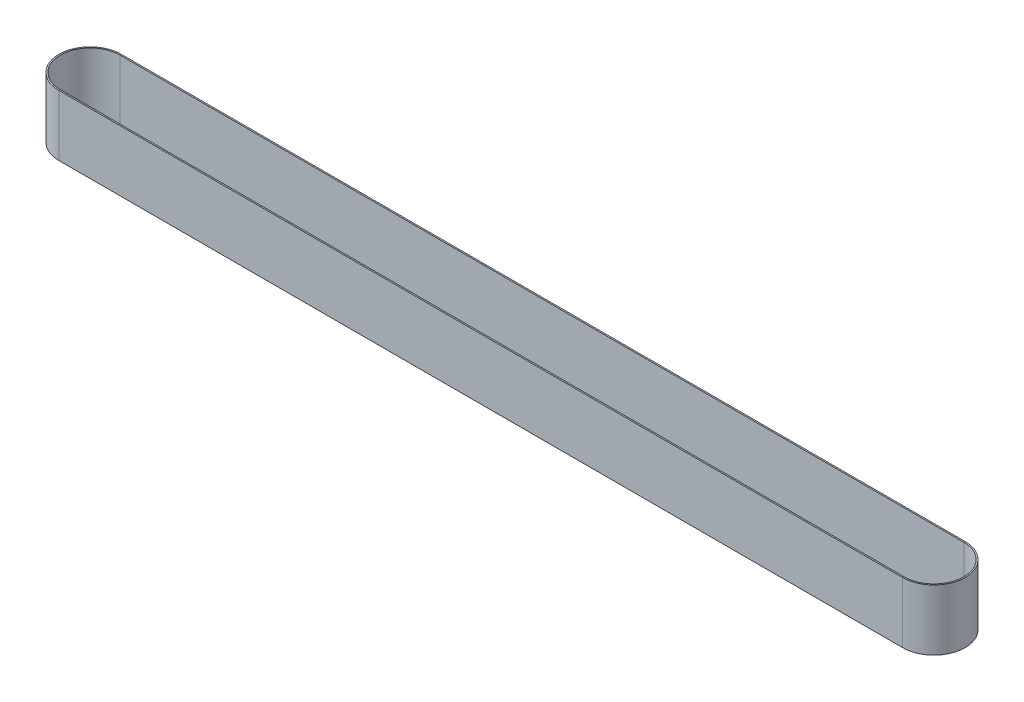
ISO-10303-21;
HEADER;
FILE_DESCRIPTION(('STEP AP214'),'2;1');
FILE_NAME('part.step','',(''),(''),'','','');
FILE_SCHEMA(('AUTOMOTIVE_DESIGN { 1 0 10303 214 1 1 1 1 }'));
ENDSEC;
DATA;
#1=APPLICATION_CONTEXT('core data for automotive mechanical design processes');
#2=APPLICATION_PROTOCOL_DEFINITION('international standard','automotive_design',2000,#1);
#3=PRODUCT_CONTEXT('',#1,'mechanical');
#4=PRODUCT('Part','Part','',(#3));
#5=PRODUCT_RELATED_PRODUCT_CATEGORY('part','',(#4));
#6=PRODUCT_DEFINITION_FORMATION('','',#4);
#7=PRODUCT_DEFINITION_CONTEXT('part definition',#1,'design');
#8=PRODUCT_DEFINITION('design','',#6,#7);
#9=PRODUCT_DEFINITION_SHAPE('','',#8);
#10=(LENGTH_UNIT() NAMED_UNIT(*) SI_UNIT(.MILLI.,.METRE.));
#11=(NAMED_UNIT(*) PLANE_ANGLE_UNIT() SI_UNIT($,.RADIAN.));
#12=(NAMED_UNIT(*) SI_UNIT($,.STERADIAN.) SOLID_ANGLE_UNIT());
#13=UNCERTAINTY_MEASURE_WITH_UNIT(LENGTH_MEASURE(1.E-05),#10,'distance_accuracy_value','');
#14=(GEOMETRIC_REPRESENTATION_CONTEXT(3) GLOBAL_UNCERTAINTY_ASSIGNED_CONTEXT((#13)) GLOBAL_UNIT_ASSIGNED_CONTEXT((#10,
#11,#12)) REPRESENTATION_CONTEXT('',''));
#15=CARTESIAN_POINT('',(0.,0.,0.));
#16=DIRECTION('',(0.,0.,1.));
#17=DIRECTION('',(1.,0.,0.));
#18=AXIS2_PLACEMENT_3D('',#15,#16,#17);
#19=CARTESIAN_POINT('',(0.,45.72,0.));
#20=DIRECTION('',(0.,1.,0.));
#21=DIRECTION('',(0.,0.,1.));
#22=AXIS2_PLACEMENT_3D('',#19,#20,#21);
#23=PLANE('',#22);
#24=CARTESIAN_POINT('',(0.,45.72,0.));
#25=DIRECTION('',(0.,1.,0.));
#26=DIRECTION('',(0.,0.,1.));
#27=AXIS2_PLACEMENT_3D('',#24,#25,#26);
#28=CIRCLE('',#27,23.5);
#29=CARTESIAN_POINT('',(0.,45.72,-23.5));
#30=VERTEX_POINT('',#29);
#31=CARTESIAN_POINT('',(0.,45.72,23.5));
#32=VERTEX_POINT('',#31);
#33=EDGE_CURVE('E134',#30,#32,#28,.T.);
#34=ORIENTED_EDGE('',*,*,#33,.T.);
#35=DIRECTION('',(1.,0.,0.));
#36=VECTOR('',#35,1.);
#37=CARTESIAN_POINT('',(0.,45.72,23.5));
#38=LINE('',#37,#36);
#39=CARTESIAN_POINT('',(635.,45.72,23.5));
#40=VERTEX_POINT('',#39);
#41=EDGE_CURVE('E137',#32,#40,#38,.T.);
#42=ORIENTED_EDGE('',*,*,#41,.T.);
#43=CARTESIAN_POINT('',(635.,45.72,0.));
#44=DIRECTION('',(0.,1.,0.));
#45=DIRECTION('',(0.,0.,1.));
#46=AXIS2_PLACEMENT_3D('',#43,#44,#45);
#47=CIRCLE('',#46,23.5);
#48=CARTESIAN_POINT('',(635.,45.72,-23.5));
#49=VERTEX_POINT('',#48);
#50=EDGE_CURVE('E140',#40,#49,#47,.T.);
#51=ORIENTED_EDGE('',*,*,#50,.T.);
#52=DIRECTION('',(-1.,0.,0.));
#53=VECTOR('',#52,1.);
#54=CARTESIAN_POINT('',(0.,45.72,-23.5));
#55=LINE('',#54,#53);
#56=EDGE_CURVE('E142',#49,#30,#55,.T.);
#57=ORIENTED_EDGE('',*,*,#56,.T.);
#58=EDGE_LOOP('',(#34,#42,#51,#57));
#59=FACE_BOUND('',#58,.T.);
#60=DIRECTION('',(1.,0.,0.));
#61=VECTOR('',#60,1.);
#62=CARTESIAN_POINT('',(0.,45.72,22.5));
#63=LINE('',#62,#61);
#64=CARTESIAN_POINT('',(0.,45.72,22.5));
#65=VERTEX_POINT('',#64);
#66=CARTESIAN_POINT('',(635.,45.72,22.5));
#67=VERTEX_POINT('',#66);
#68=EDGE_CURVE('E106',#65,#67,#63,.T.);
#69=ORIENTED_EDGE('',*,*,#68,.F.);
#70=CARTESIAN_POINT('',(0.,45.72,0.));
#71=DIRECTION('',(0.,1.,0.));
#72=DIRECTION('',(0.,0.,1.));
#73=AXIS2_PLACEMENT_3D('',#70,#71,#72);
#74=CIRCLE('',#73,22.5);
#75=CARTESIAN_POINT('',(0.,45.72,-22.5));
#76=VERTEX_POINT('',#75);
#77=EDGE_CURVE('E98',#76,#65,#74,.T.);
#78=ORIENTED_EDGE('',*,*,#77,.F.);
#79=DIRECTION('',(-1.,0.,0.));
#80=VECTOR('',#79,1.);
#81=CARTESIAN_POINT('',(0.,45.72,-22.5));
#82=LINE('',#81,#80);
#83=CARTESIAN_POINT('',(635.,45.72,-22.5));
#84=VERTEX_POINT('',#83);
#85=EDGE_CURVE('E120',#84,#76,#82,.T.);
#86=ORIENTED_EDGE('',*,*,#85,.F.);
#87=CARTESIAN_POINT('',(635.,45.72,0.));
#88=DIRECTION('',(0.,1.,0.));
#89=DIRECTION('',(0.,0.,1.));
#90=AXIS2_PLACEMENT_3D('',#87,#88,#89);
#91=CIRCLE('',#90,22.5);
#92=EDGE_CURVE('E118',#67,#84,#91,.T.);
#93=ORIENTED_EDGE('',*,*,#92,.F.);
#94=EDGE_LOOP('',(#69,#78,#86,#93));
#95=FACE_BOUND('',#94,.T.);
#96=ADVANCED_FACE('F33',(#59,#95),#23,.T.);
#97=CARTESIAN_POINT('',(0.,0.,0.));
#98=DIRECTION('',(0.,1.,0.));
#99=DIRECTION('',(0.,0.,1.));
#100=AXIS2_PLACEMENT_3D('',#97,#98,#99);
#101=PLANE('',#100);
#102=CARTESIAN_POINT('',(0.,0.,0.));
#103=DIRECTION('',(0.,1.,0.));
#104=DIRECTION('',(0.,0.,1.));
#105=AXIS2_PLACEMENT_3D('',#102,#103,#104);
#106=CIRCLE('',#105,23.5);
#107=CARTESIAN_POINT('',(0.,0.,-23.5));
#108=VERTEX_POINT('',#107);
#109=CARTESIAN_POINT('',(0.,0.,23.5));
#110=VERTEX_POINT('',#109);
#111=EDGE_CURVE('E114',#108,#110,#106,.T.);
#112=ORIENTED_EDGE('',*,*,#111,.F.);
#113=DIRECTION('',(-1.,0.,0.));
#114=VECTOR('',#113,1.);
#115=CARTESIAN_POINT('',(0.,0.,-23.5));
#116=LINE('',#115,#114);
#117=CARTESIAN_POINT('',(635.,0.,-23.5));
#118=VERTEX_POINT('',#117);
#119=EDGE_CURVE('E138',#118,#108,#116,.T.);
#120=ORIENTED_EDGE('',*,*,#119,.F.);
#121=CARTESIAN_POINT('',(635.,0.,0.));
#122=DIRECTION('',(0.,1.,0.));
#123=DIRECTION('',(0.,0.,1.));
#124=AXIS2_PLACEMENT_3D('',#121,#122,#123);
#125=CIRCLE('',#124,23.5);
#126=CARTESIAN_POINT('',(635.,0.,23.5));
#127=VERTEX_POINT('',#126);
#128=EDGE_CURVE('E149',#127,#118,#125,.T.);
#129=ORIENTED_EDGE('',*,*,#128,.F.);
#130=DIRECTION('',(1.,0.,0.));
#131=VECTOR('',#130,1.);
#132=CARTESIAN_POINT('',(0.,0.,23.5));
#133=LINE('',#132,#131);
#134=EDGE_CURVE('E147',#110,#127,#133,.T.);
#135=ORIENTED_EDGE('',*,*,#134,.F.);
#136=EDGE_LOOP('',(#112,#120,#129,#135));
#137=FACE_BOUND('',#136,.T.);
#138=CARTESIAN_POINT('',(0.,0.,0.));
#139=DIRECTION('',(0.,1.,0.));
#140=DIRECTION('',(0.,0.,1.));
#141=AXIS2_PLACEMENT_3D('',#138,#139,#140);
#142=CIRCLE('',#141,22.5);
#143=CARTESIAN_POINT('',(0.,0.,-22.5));
#144=VERTEX_POINT('',#143);
#145=CARTESIAN_POINT('',(0.,0.,22.5));
#146=VERTEX_POINT('',#145);
#147=EDGE_CURVE('E56',#144,#146,#142,.T.);
#148=ORIENTED_EDGE('',*,*,#147,.T.);
#149=DIRECTION('',(1.,0.,0.));
#150=VECTOR('',#149,1.);
#151=CARTESIAN_POINT('',(0.,0.,22.5));
#152=LINE('',#151,#150);
#153=CARTESIAN_POINT('',(635.,0.,22.5));
#154=VERTEX_POINT('',#153);
#155=EDGE_CURVE('E113',#146,#154,#152,.T.);
#156=ORIENTED_EDGE('',*,*,#155,.T.);
#157=CARTESIAN_POINT('',(635.,0.,0.));
#158=DIRECTION('',(0.,1.,0.));
#159=DIRECTION('',(0.,0.,1.));
#160=AXIS2_PLACEMENT_3D('',#157,#158,#159);
#161=CIRCLE('',#160,22.5);
#162=CARTESIAN_POINT('',(635.,0.,-22.5));
#163=VERTEX_POINT('',#162);
#164=EDGE_CURVE('E126',#154,#163,#161,.T.);
#165=ORIENTED_EDGE('',*,*,#164,.T.);
#166=DIRECTION('',(-1.,0.,0.));
#167=VECTOR('',#166,1.);
#168=CARTESIAN_POINT('',(0.,0.,-22.5));
#169=LINE('',#168,#167);
#170=EDGE_CURVE('E107',#163,#144,#169,.T.);
#171=ORIENTED_EDGE('',*,*,#170,.T.);
#172=EDGE_LOOP('',(#148,#156,#165,#171));
#173=FACE_BOUND('',#172,.T.);
#174=ADVANCED_FACE('F167',(#137,#173),#101,.F.);
#175=CARTESIAN_POINT('',(0.,45.72,0.));
#176=DIRECTION('',(0.,-1.,0.));
#177=DIRECTION('',(0.,0.,-1.));
#178=AXIS2_PLACEMENT_3D('',#175,#176,#177);
#179=CYLINDRICAL_SURFACE('',#178,23.5);
#180=ORIENTED_EDGE('',*,*,#111,.T.);
#181=DIRECTION('',(0.,-1.,0.));
#182=VECTOR('',#181,1.);
#183=CARTESIAN_POINT('',(0.,45.72,23.5));
#184=LINE('',#183,#182);
#185=EDGE_CURVE('E11',#32,#110,#184,.T.);
#186=ORIENTED_EDGE('',*,*,#185,.F.);
#187=ORIENTED_EDGE('',*,*,#33,.F.);
#188=DIRECTION('',(0.,-1.,0.));
#189=VECTOR('',#188,1.);
#190=CARTESIAN_POINT('',(0.,45.72,-23.5));
#191=LINE('',#190,#189);
#192=EDGE_CURVE('E144',#30,#108,#191,.T.);
#193=ORIENTED_EDGE('',*,*,#192,.T.);
#194=EDGE_LOOP('',(#180,#186,#187,#193));
#195=FACE_BOUND('',#194,.T.);
#196=ADVANCED_FACE('F35',(#195),#179,.T.);
#197=CARTESIAN_POINT('',(0.,45.72,23.5));
#198=DIRECTION('',(0.,0.,-1.));
#199=DIRECTION('',(-1.,0.,0.));
#200=AXIS2_PLACEMENT_3D('',#197,#198,#199);
#201=PLANE('',#200);
#202=ORIENTED_EDGE('',*,*,#134,.T.);
#203=DIRECTION('',(0.,-1.,0.));
#204=VECTOR('',#203,1.);
#205=CARTESIAN_POINT('',(635.,45.72,23.5));
#206=LINE('',#205,#204);
#207=EDGE_CURVE('E41',#40,#127,#206,.T.);
#208=ORIENTED_EDGE('',*,*,#207,.F.);
#209=ORIENTED_EDGE('',*,*,#41,.F.);
#210=ORIENTED_EDGE('',*,*,#185,.T.);
#211=EDGE_LOOP('',(#202,#208,#209,#210));
#212=FACE_BOUND('',#211,.T.);
#213=ADVANCED_FACE('F177',(#212),#201,.F.);
#214=CARTESIAN_POINT('',(635.,45.72,0.));
#215=DIRECTION('',(0.,-1.,0.));
#216=DIRECTION('',(0.,0.,-1.));
#217=AXIS2_PLACEMENT_3D('',#214,#215,#216);
#218=CYLINDRICAL_SURFACE('',#217,23.5);
#219=ORIENTED_EDGE('',*,*,#128,.T.);
#220=DIRECTION('',(0.,-1.,0.));
#221=VECTOR('',#220,1.);
#222=CARTESIAN_POINT('',(635.,45.72,-23.5));
#223=LINE('',#222,#221);
#224=EDGE_CURVE('E154',#49,#118,#223,.T.);
#225=ORIENTED_EDGE('',*,*,#224,.F.);
#226=ORIENTED_EDGE('',*,*,#50,.F.);
#227=ORIENTED_EDGE('',*,*,#207,.T.);
#228=EDGE_LOOP('',(#219,#225,#226,#227));
#229=FACE_BOUND('',#228,.T.);
#230=ADVANCED_FACE('F161',(#229),#218,.T.);
#231=CARTESIAN_POINT('',(0.,45.72,-23.5));
#232=DIRECTION('',(0.,0.,1.));
#233=DIRECTION('',(1.,0.,0.));
#234=AXIS2_PLACEMENT_3D('',#231,#232,#233);
#235=PLANE('',#234);
#236=ORIENTED_EDGE('',*,*,#119,.T.);
#237=ORIENTED_EDGE('',*,*,#192,.F.);
#238=ORIENTED_EDGE('',*,*,#56,.F.);
#239=ORIENTED_EDGE('',*,*,#224,.T.);
#240=EDGE_LOOP('',(#236,#237,#238,#239));
#241=FACE_BOUND('',#240,.T.);
#242=ADVANCED_FACE('F171',(#241),#235,.F.);
#243=CARTESIAN_POINT('',(0.,45.72,0.));
#244=DIRECTION('',(0.,-1.,0.));
#245=DIRECTION('',(0.,0.,-1.));
#246=AXIS2_PLACEMENT_3D('',#243,#244,#245);
#247=CYLINDRICAL_SURFACE('',#246,22.5);
#248=ORIENTED_EDGE('',*,*,#147,.F.);
#249=DIRECTION('',(0.,-1.,0.));
#250=VECTOR('',#249,1.);
#251=CARTESIAN_POINT('',(0.,45.72,-22.5));
#252=LINE('',#251,#250);
#253=EDGE_CURVE('E102',#76,#144,#252,.T.);
#254=ORIENTED_EDGE('',*,*,#253,.F.);
#255=ORIENTED_EDGE('',*,*,#77,.T.);
#256=DIRECTION('',(0.,-1.,0.));
#257=VECTOR('',#256,1.);
#258=CARTESIAN_POINT('',(0.,45.72,22.5));
#259=LINE('',#258,#257);
#260=EDGE_CURVE('E101',#65,#146,#259,.T.);
#261=ORIENTED_EDGE('',*,*,#260,.T.);
#262=EDGE_LOOP('',(#248,#254,#255,#261));
#263=FACE_BOUND('',#262,.T.);
#264=ADVANCED_FACE('F100',(#263),#247,.F.);
#265=CARTESIAN_POINT('',(0.,45.72,22.5));
#266=DIRECTION('',(0.,0.,-1.));
#267=DIRECTION('',(-1.,0.,0.));
#268=AXIS2_PLACEMENT_3D('',#265,#266,#267);
#269=PLANE('',#268);
#270=ORIENTED_EDGE('',*,*,#155,.F.);
#271=ORIENTED_EDGE('',*,*,#260,.F.);
#272=ORIENTED_EDGE('',*,*,#68,.T.);
#273=DIRECTION('',(0.,-1.,0.));
#274=VECTOR('',#273,1.);
#275=CARTESIAN_POINT('',(635.,45.72,22.5));
#276=LINE('',#275,#274);
#277=EDGE_CURVE('E115',#67,#154,#276,.T.);
#278=ORIENTED_EDGE('',*,*,#277,.T.);
#279=EDGE_LOOP('',(#270,#271,#272,#278));
#280=FACE_BOUND('',#279,.T.);
#281=ADVANCED_FACE('F110',(#280),#269,.T.);
#282=CARTESIAN_POINT('',(635.,45.72,0.));
#283=DIRECTION('',(0.,-1.,0.));
#284=DIRECTION('',(0.,0.,-1.));
#285=AXIS2_PLACEMENT_3D('',#282,#283,#284);
#286=CYLINDRICAL_SURFACE('',#285,22.5);
#287=ORIENTED_EDGE('',*,*,#164,.F.);
#288=ORIENTED_EDGE('',*,*,#277,.F.);
#289=ORIENTED_EDGE('',*,*,#92,.T.);
#290=DIRECTION('',(0.,-1.,0.));
#291=VECTOR('',#290,1.);
#292=CARTESIAN_POINT('',(635.,45.72,-22.5));
#293=LINE('',#292,#291);
#294=EDGE_CURVE('E48',#84,#163,#293,.T.);
#295=ORIENTED_EDGE('',*,*,#294,.T.);
#296=EDGE_LOOP('',(#287,#288,#289,#295));
#297=FACE_BOUND('',#296,.T.);
#298=ADVANCED_FACE('F200',(#297),#286,.F.);
#299=CARTESIAN_POINT('',(0.,45.72,-22.5));
#300=DIRECTION('',(0.,0.,1.));
#301=DIRECTION('',(1.,0.,0.));
#302=AXIS2_PLACEMENT_3D('',#299,#300,#301);
#303=PLANE('',#302);
#304=ORIENTED_EDGE('',*,*,#170,.F.);
#305=ORIENTED_EDGE('',*,*,#294,.F.);
#306=ORIENTED_EDGE('',*,*,#85,.T.);
#307=ORIENTED_EDGE('',*,*,#253,.T.);
#308=EDGE_LOOP('',(#304,#305,#306,#307));
#309=FACE_BOUND('',#308,.T.);
#310=ADVANCED_FACE('F204',(#309),#303,.T.);
#311=CLOSED_SHELL('',(#96,#174,#196,#213,#230,#242,#264,#281,#298,#310));
#312=MANIFOLD_SOLID_BREP('B2',#311);
#313=ADVANCED_BREP_SHAPE_REPRESENTATION('',(#18,#312),#14);
#314=SHAPE_DEFINITION_REPRESENTATION(#9,#313);
ENDSEC;
END-ISO-10303-21;
